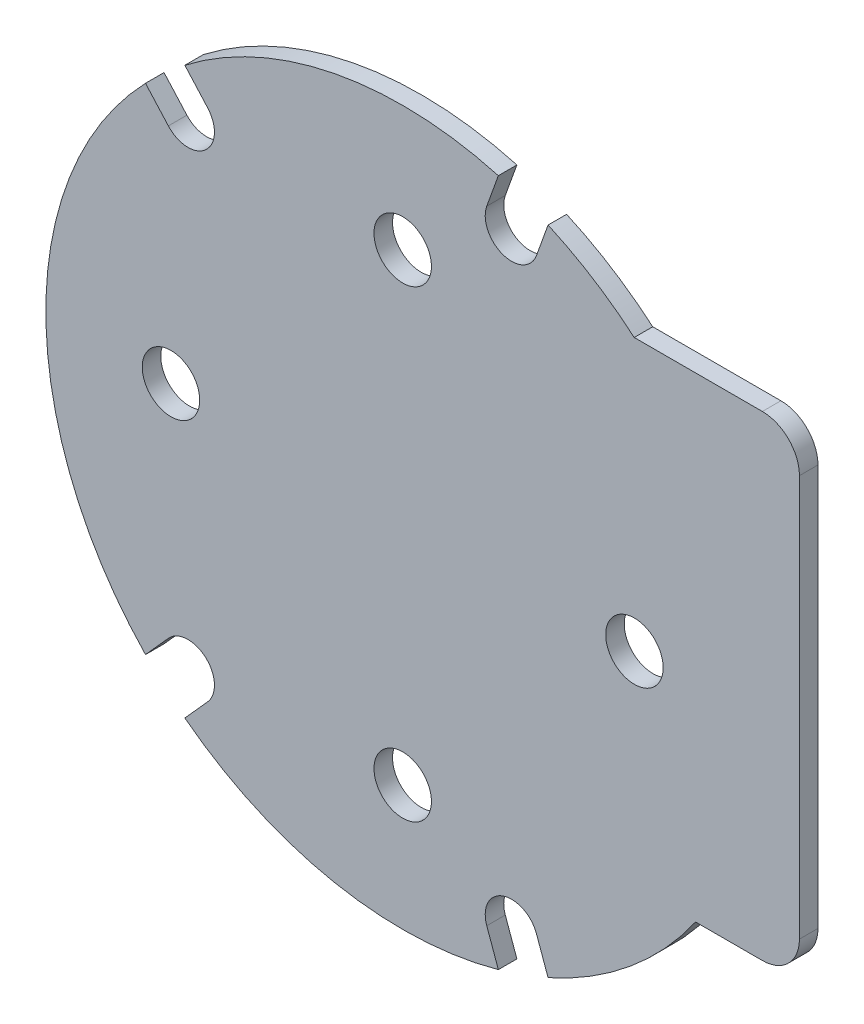
ISO-10303-21;
HEADER;
FILE_DESCRIPTION(('STEP AP214'),'2;1');
FILE_NAME('part.step','',(''),(''),'','','');
FILE_SCHEMA(('AUTOMOTIVE_DESIGN { 1 0 10303 214 1 1 1 1 }'));
ENDSEC;
DATA;
#1=APPLICATION_CONTEXT('core data for automotive mechanical design processes');
#2=APPLICATION_PROTOCOL_DEFINITION('international standard','automotive_design',2000,#1);
#3=PRODUCT_CONTEXT('',#1,'mechanical');
#4=PRODUCT('Part','Part','',(#3));
#5=PRODUCT_RELATED_PRODUCT_CATEGORY('part','',(#4));
#6=PRODUCT_DEFINITION_FORMATION('','',#4);
#7=PRODUCT_DEFINITION_CONTEXT('part definition',#1,'design');
#8=PRODUCT_DEFINITION('design','',#6,#7);
#9=PRODUCT_DEFINITION_SHAPE('','',#8);
#10=(LENGTH_UNIT() NAMED_UNIT(*) SI_UNIT(.MILLI.,.METRE.));
#11=(NAMED_UNIT(*) PLANE_ANGLE_UNIT() SI_UNIT($,.RADIAN.));
#12=(NAMED_UNIT(*) SI_UNIT($,.STERADIAN.) SOLID_ANGLE_UNIT());
#13=UNCERTAINTY_MEASURE_WITH_UNIT(LENGTH_MEASURE(1.E-05),#10,'distance_accuracy_value','');
#14=(GEOMETRIC_REPRESENTATION_CONTEXT(3) GLOBAL_UNCERTAINTY_ASSIGNED_CONTEXT((#13)) GLOBAL_UNIT_ASSIGNED_CONTEXT((#10,
#11,#12)) REPRESENTATION_CONTEXT('',''));
#15=CARTESIAN_POINT('',(0.,0.,0.));
#16=DIRECTION('',(0.,0.,1.));
#17=DIRECTION('',(1.,0.,0.));
#18=AXIS2_PLACEMENT_3D('',#15,#16,#17);
#19=CARTESIAN_POINT('',(0.,0.,2.));
#20=DIRECTION('',(0.,0.,1.));
#21=DIRECTION('',(1.,0.,0.));
#22=AXIS2_PLACEMENT_3D('',#19,#20,#21);
#23=PLANE('',#22);
#24=CARTESIAN_POINT('',(0.,25.,2.));
#25=DIRECTION('',(0.,0.,1.));
#26=DIRECTION('',(1.,0.,0.));
#27=AXIS2_PLACEMENT_3D('',#24,#25,#26);
#28=CIRCLE('',#27,3.1);
#29=CARTESIAN_POINT('',(3.09999999999999,25.,2.));
#30=VERTEX_POINT('',#29);
#31=EDGE_CURVE('E309',#30,#30,#28,.T.);
#32=ORIENTED_EDGE('',*,*,#31,.F.);
#33=EDGE_LOOP('',(#32));
#34=FACE_BOUND('',#33,.T.);
#35=CARTESIAN_POINT('',(0.,-25.,2.));
#36=DIRECTION('',(0.,0.,1.));
#37=DIRECTION('',(1.,0.,0.));
#38=AXIS2_PLACEMENT_3D('',#35,#36,#37);
#39=CIRCLE('',#38,3.1);
#40=CARTESIAN_POINT('',(3.10000000000001,-25.,2.));
#41=VERTEX_POINT('',#40);
#42=EDGE_CURVE('E321',#41,#41,#39,.T.);
#43=ORIENTED_EDGE('',*,*,#42,.F.);
#44=EDGE_LOOP('',(#43));
#45=FACE_BOUND('',#44,.T.);
#46=CARTESIAN_POINT('',(-25.,0.,2.));
#47=DIRECTION('',(0.,0.,1.));
#48=DIRECTION('',(1.,0.,0.));
#49=AXIS2_PLACEMENT_3D('',#46,#47,#48);
#50=CIRCLE('',#49,3.1);
#51=CARTESIAN_POINT('',(-21.9,0.,2.));
#52=VERTEX_POINT('',#51);
#53=EDGE_CURVE('E315',#52,#52,#50,.T.);
#54=ORIENTED_EDGE('',*,*,#53,.F.);
#55=EDGE_LOOP('',(#54));
#56=FACE_BOUND('',#55,.T.);
#57=CARTESIAN_POINT('',(25.,0.,2.));
#58=DIRECTION('',(0.,0.,1.));
#59=DIRECTION('',(1.,0.,0.));
#60=AXIS2_PLACEMENT_3D('',#57,#58,#59);
#61=CIRCLE('',#60,3.1);
#62=CARTESIAN_POINT('',(28.1,0.,2.));
#63=VERTEX_POINT('',#62);
#64=EDGE_CURVE('E303',#63,#63,#61,.T.);
#65=ORIENTED_EDGE('',*,*,#64,.F.);
#66=EDGE_LOOP('',(#65));
#67=FACE_BOUND('',#66,.T.);
#68=DIRECTION('',(0.,1.,0.));
#69=VECTOR('',#68,1.);
#70=CARTESIAN_POINT('',(42.8,29.3,2.));
#71=LINE('',#70,#69);
#72=CARTESIAN_POINT('',(42.8,-18.,2.));
#73=VERTEX_POINT('',#72);
#74=CARTESIAN_POINT('',(42.8,25.3,2.));
#75=VERTEX_POINT('',#74);
#76=EDGE_CURVE('E332',#73,#75,#71,.T.);
#77=ORIENTED_EDGE('',*,*,#76,.T.);
#78=CARTESIAN_POINT('',(38.8,25.3,2.));
#79=DIRECTION('',(0.,0.,1.));
#80=DIRECTION('',(1.,0.,0.));
#81=AXIS2_PLACEMENT_3D('',#78,#79,#80);
#82=CIRCLE('',#81,4.);
#83=CARTESIAN_POINT('',(38.8,29.3,2.));
#84=VERTEX_POINT('',#83);
#85=EDGE_CURVE('E40',#75,#84,#82,.T.);
#86=ORIENTED_EDGE('',*,*,#85,.T.);
#87=DIRECTION('',(-1.,0.,0.));
#88=VECTOR('',#87,1.);
#89=CARTESIAN_POINT('',(24.9751876869825,29.3,2.));
#90=LINE('',#89,#88);
#91=CARTESIAN_POINT('',(24.9751876869825,29.3,2.));
#92=VERTEX_POINT('',#91);
#93=EDGE_CURVE('E334',#84,#92,#90,.T.);
#94=ORIENTED_EDGE('',*,*,#93,.T.);
#95=CARTESIAN_POINT('',(0.,0.,2.));
#96=DIRECTION('',(0.,0.,1.));
#97=DIRECTION('',(1.,0.,0.));
#98=AXIS2_PLACEMENT_3D('',#95,#96,#97);
#99=CIRCLE('',#98,38.5);
#100=CARTESIAN_POINT('',(15.6828384392033,35.161037790285,2.));
#101=VERTEX_POINT('',#100);
#102=EDGE_CURVE('E207',#92,#101,#99,.T.);
#103=ORIENTED_EDGE('',*,*,#102,.T.);
#104=DIRECTION('',(0.338622846225681,0.940922190201729,0.));
#105=VECTOR('',#104,1.);
#106=CARTESIAN_POINT('',(14.4318410061061,31.6849248882568,2.));
#107=LINE('',#106,#105);
#108=CARTESIAN_POINT('',(14.4318410061061,31.6849248882568,2.));
#109=VERTEX_POINT('',#108);
#110=EDGE_CURVE('E194',#109,#101,#107,.T.);
#111=ORIENTED_EDGE('',*,*,#110,.F.);
#112=CARTESIAN_POINT('',(11.7502127640311,32.65,2.));
#113=DIRECTION('',(0.,0.,1.));
#114=DIRECTION('',(1.,0.,0.));
#115=AXIS2_PLACEMENT_3D('',#112,#113,#114);
#116=CIRCLE('',#115,2.85);
#117=CARTESIAN_POINT('',(9.06858452195621,33.6150751117432,2.));
#118=VERTEX_POINT('',#117);
#119=EDGE_CURVE('E184',#118,#109,#116,.T.);
#120=ORIENTED_EDGE('',*,*,#119,.F.);
#121=DIRECTION('',(-0.338622846225681,-0.940922190201729,0.));
#122=VECTOR('',#121,1.);
#123=CARTESIAN_POINT('',(9.06858452195621,33.6150751117432,2.));
#124=LINE('',#123,#122);
#125=CARTESIAN_POINT('',(10.3195819550534,37.0911880137714,2.));
#126=VERTEX_POINT('',#125);
#127=EDGE_CURVE('E208',#126,#118,#124,.T.);
#128=ORIENTED_EDGE('',*,*,#127,.F.);
#129=CARTESIAN_POINT('',(-23.5034170023146,30.493267932698,2.));
#130=VERTEX_POINT('',#129);
#131=EDGE_CURVE('E329',#126,#130,#99,.T.);
#132=ORIENTED_EDGE('',*,*,#131,.T.);
#133=DIRECTION('',(-0.667434411909216,0.744668587896253,0.));
#134=VECTOR('',#133,1.);
#135=CARTESIAN_POINT('',(-21.0376686177454,27.7421880739413,2.));
#136=LINE('',#135,#134);
#137=CARTESIAN_POINT('',(-21.0376686177454,27.7421880739413,2.));
#138=VERTEX_POINT('',#137);
#139=EDGE_CURVE('E224',#138,#130,#136,.T.);
#140=ORIENTED_EDGE('',*,*,#139,.F.);
#141=CARTESIAN_POINT('',(-23.1599740932498,25.84,2.));
#142=DIRECTION('',(0.,0.,1.));
#143=DIRECTION('',(1.,0.,0.));
#144=AXIS2_PLACEMENT_3D('',#141,#142,#143);
#145=CIRCLE('',#144,2.85);
#146=CARTESIAN_POINT('',(-25.2822795687541,23.9378119260587,2.));
#147=VERTEX_POINT('',#146);
#148=EDGE_CURVE('E222',#147,#138,#145,.T.);
#149=ORIENTED_EDGE('',*,*,#148,.F.);
#150=DIRECTION('',(0.667434411909216,-0.744668587896253,0.));
#151=VECTOR('',#150,1.);
#152=CARTESIAN_POINT('',(-25.2822795687541,23.9378119260587,2.));
#153=LINE('',#152,#151);
#154=CARTESIAN_POINT('',(-27.7480279533233,26.6888917848155,2.));
#155=VERTEX_POINT('',#154);
#156=EDGE_CURVE('E228',#155,#147,#153,.T.);
#157=ORIENTED_EDGE('',*,*,#156,.F.);
#158=CARTESIAN_POINT('',(-27.7480279533233,-26.6888917848155,2.));
#159=VERTEX_POINT('',#158);
#160=EDGE_CURVE('E411',#155,#159,#99,.T.);
#161=ORIENTED_EDGE('',*,*,#160,.T.);
#162=DIRECTION('',(-0.667434411909216,-0.744668587896253,0.));
#163=VECTOR('',#162,1.);
#164=CARTESIAN_POINT('',(-25.2822795687541,-23.9378119260587,2.));
#165=LINE('',#164,#163);
#166=CARTESIAN_POINT('',(-25.2822795687541,-23.9378119260587,2.));
#167=VERTEX_POINT('',#166);
#168=EDGE_CURVE('E251',#167,#159,#165,.T.);
#169=ORIENTED_EDGE('',*,*,#168,.F.);
#170=CARTESIAN_POINT('',(-23.1599740932498,-25.84,2.));
#171=DIRECTION('',(0.,0.,1.));
#172=DIRECTION('',(-1.,0.,0.));
#173=AXIS2_PLACEMENT_3D('',#170,#171,#172);
#174=CIRCLE('',#173,2.85);
#175=CARTESIAN_POINT('',(-21.0376686177454,-27.7421880739413,2.));
#176=VERTEX_POINT('',#175);
#177=EDGE_CURVE('E249',#176,#167,#174,.T.);
#178=ORIENTED_EDGE('',*,*,#177,.F.);
#179=DIRECTION('',(0.667434411909216,0.744668587896253,0.));
#180=VECTOR('',#179,1.);
#181=CARTESIAN_POINT('',(-21.0376686177454,-27.7421880739413,2.));
#182=LINE('',#181,#180);
#183=CARTESIAN_POINT('',(-23.5034170023146,-30.493267932698,2.));
#184=VERTEX_POINT('',#183);
#185=EDGE_CURVE('E255',#184,#176,#182,.T.);
#186=ORIENTED_EDGE('',*,*,#185,.F.);
#187=CARTESIAN_POINT('',(10.3195819550534,-37.0911880137714,2.));
#188=VERTEX_POINT('',#187);
#189=EDGE_CURVE('E412',#184,#188,#99,.T.);
#190=ORIENTED_EDGE('',*,*,#189,.T.);
#191=DIRECTION('',(0.338622846225681,-0.940922190201729,0.));
#192=VECTOR('',#191,1.);
#193=CARTESIAN_POINT('',(9.06858452195621,-33.6150751117432,2.));
#194=LINE('',#193,#192);
#195=CARTESIAN_POINT('',(9.06858452195621,-33.6150751117432,2.));
#196=VERTEX_POINT('',#195);
#197=EDGE_CURVE('E278',#196,#188,#194,.T.);
#198=ORIENTED_EDGE('',*,*,#197,.F.);
#199=CARTESIAN_POINT('',(11.7502127640311,-32.65,2.));
#200=DIRECTION('',(0.,0.,1.));
#201=DIRECTION('',(-1.,0.,0.));
#202=AXIS2_PLACEMENT_3D('',#199,#200,#201);
#203=CIRCLE('',#202,2.85);
#204=CARTESIAN_POINT('',(14.4318410061061,-31.6849248882568,2.));
#205=VERTEX_POINT('',#204);
#206=EDGE_CURVE('E276',#205,#196,#203,.T.);
#207=ORIENTED_EDGE('',*,*,#206,.F.);
#208=DIRECTION('',(-0.338622846225681,0.940922190201729,0.));
#209=VECTOR('',#208,1.);
#210=CARTESIAN_POINT('',(14.4318410061061,-31.6849248882568,2.));
#211=LINE('',#210,#209);
#212=CARTESIAN_POINT('',(15.6828384392033,-35.161037790285,2.));
#213=VERTEX_POINT('',#212);
#214=EDGE_CURVE('E282',#213,#205,#211,.T.);
#215=ORIENTED_EDGE('',*,*,#214,.F.);
#216=CARTESIAN_POINT('',(31.5950945559592,-22.,2.));
#217=VERTEX_POINT('',#216);
#218=EDGE_CURVE('E330',#213,#217,#99,.T.);
#219=ORIENTED_EDGE('',*,*,#218,.T.);
#220=DIRECTION('',(1.,0.,0.));
#221=VECTOR('',#220,1.);
#222=CARTESIAN_POINT('',(42.8,-22.,2.));
#223=LINE('',#222,#221);
#224=CARTESIAN_POINT('',(38.8,-22.,2.));
#225=VERTEX_POINT('',#224);
#226=EDGE_CURVE('E328',#217,#225,#223,.T.);
#227=ORIENTED_EDGE('',*,*,#226,.T.);
#228=CARTESIAN_POINT('',(38.8,-18.,2.));
#229=DIRECTION('',(0.,0.,1.));
#230=DIRECTION('',(1.,0.,0.));
#231=AXIS2_PLACEMENT_3D('',#228,#229,#230);
#232=CIRCLE('',#231,4.);
#233=EDGE_CURVE('E363',#225,#73,#232,.T.);
#234=ORIENTED_EDGE('',*,*,#233,.T.);
#235=EDGE_LOOP('',(#77,#86,#94,#103,#111,#120,#128,#132,#140,#149,#157,#161,#169,#178,#186,#190,
#198,#207,#215,#219,#227,#234));
#236=FACE_BOUND('',#235,.T.);
#237=ADVANCED_FACE('F32',(#34,#45,#56,#67,#236),#23,.T.);
#238=CARTESIAN_POINT('',(0.,0.,0.));
#239=DIRECTION('',(0.,0.,1.));
#240=DIRECTION('',(1.,0.,0.));
#241=AXIS2_PLACEMENT_3D('',#238,#239,#240);
#242=PLANE('',#241);
#243=CARTESIAN_POINT('',(0.,25.,0.));
#244=DIRECTION('',(0.,0.,1.));
#245=DIRECTION('',(1.,0.,0.));
#246=AXIS2_PLACEMENT_3D('',#243,#244,#245);
#247=CIRCLE('',#246,3.1);
#248=CARTESIAN_POINT('',(3.09999999999999,25.,0.));
#249=VERTEX_POINT('',#248);
#250=EDGE_CURVE('E306',#249,#249,#247,.T.);
#251=ORIENTED_EDGE('',*,*,#250,.T.);
#252=EDGE_LOOP('',(#251));
#253=FACE_BOUND('',#252,.T.);
#254=CARTESIAN_POINT('',(0.,-25.,0.));
#255=DIRECTION('',(0.,0.,1.));
#256=DIRECTION('',(1.,0.,0.));
#257=AXIS2_PLACEMENT_3D('',#254,#255,#256);
#258=CIRCLE('',#257,3.1);
#259=CARTESIAN_POINT('',(3.10000000000001,-25.,0.));
#260=VERTEX_POINT('',#259);
#261=EDGE_CURVE('E318',#260,#260,#258,.T.);
#262=ORIENTED_EDGE('',*,*,#261,.T.);
#263=EDGE_LOOP('',(#262));
#264=FACE_BOUND('',#263,.T.);
#265=CARTESIAN_POINT('',(-25.,0.,0.));
#266=DIRECTION('',(0.,0.,1.));
#267=DIRECTION('',(1.,0.,0.));
#268=AXIS2_PLACEMENT_3D('',#265,#266,#267);
#269=CIRCLE('',#268,3.1);
#270=CARTESIAN_POINT('',(-21.9,0.,0.));
#271=VERTEX_POINT('',#270);
#272=EDGE_CURVE('E312',#271,#271,#269,.T.);
#273=ORIENTED_EDGE('',*,*,#272,.T.);
#274=EDGE_LOOP('',(#273));
#275=FACE_BOUND('',#274,.T.);
#276=CARTESIAN_POINT('',(25.,0.,0.));
#277=DIRECTION('',(0.,0.,1.));
#278=DIRECTION('',(1.,0.,0.));
#279=AXIS2_PLACEMENT_3D('',#276,#277,#278);
#280=CIRCLE('',#279,3.1);
#281=CARTESIAN_POINT('',(28.1,0.,0.));
#282=VERTEX_POINT('',#281);
#283=EDGE_CURVE('E302',#282,#282,#280,.T.);
#284=ORIENTED_EDGE('',*,*,#283,.T.);
#285=EDGE_LOOP('',(#284));
#286=FACE_BOUND('',#285,.T.);
#287=DIRECTION('',(-1.,0.,0.));
#288=VECTOR('',#287,1.);
#289=CARTESIAN_POINT('',(24.9751876869825,29.3,0.));
#290=LINE('',#289,#288);
#291=CARTESIAN_POINT('',(38.8,29.3,0.));
#292=VERTEX_POINT('',#291);
#293=CARTESIAN_POINT('',(24.9751876869825,29.3,0.));
#294=VERTEX_POINT('',#293);
#295=EDGE_CURVE('E345',#292,#294,#290,.T.);
#296=ORIENTED_EDGE('',*,*,#295,.F.);
#297=CARTESIAN_POINT('',(38.8,25.3,0.));
#298=DIRECTION('',(0.,0.,1.));
#299=DIRECTION('',(1.,0.,0.));
#300=AXIS2_PLACEMENT_3D('',#297,#298,#299);
#301=CIRCLE('',#300,4.);
#302=CARTESIAN_POINT('',(42.8,25.3,0.));
#303=VERTEX_POINT('',#302);
#304=EDGE_CURVE('E357',#292,#303,#301,.F.);
#305=ORIENTED_EDGE('',*,*,#304,.T.);
#306=DIRECTION('',(0.,1.,0.));
#307=VECTOR('',#306,1.);
#308=CARTESIAN_POINT('',(42.8,29.3,0.));
#309=LINE('',#308,#307);
#310=CARTESIAN_POINT('',(42.8,-18.,0.));
#311=VERTEX_POINT('',#310);
#312=EDGE_CURVE('E343',#311,#303,#309,.T.);
#313=ORIENTED_EDGE('',*,*,#312,.F.);
#314=CARTESIAN_POINT('',(38.8,-18.,0.));
#315=DIRECTION('',(0.,0.,1.));
#316=DIRECTION('',(1.,0.,0.));
#317=AXIS2_PLACEMENT_3D('',#314,#315,#316);
#318=CIRCLE('',#317,4.);
#319=CARTESIAN_POINT('',(38.8,-22.,0.));
#320=VERTEX_POINT('',#319);
#321=EDGE_CURVE('E355',#311,#320,#318,.F.);
#322=ORIENTED_EDGE('',*,*,#321,.T.);
#323=DIRECTION('',(1.,0.,0.));
#324=VECTOR('',#323,1.);
#325=CARTESIAN_POINT('',(42.8,-22.,0.));
#326=LINE('',#325,#324);
#327=CARTESIAN_POINT('',(31.5950945559592,-22.,0.));
#328=VERTEX_POINT('',#327);
#329=EDGE_CURVE('E340',#328,#320,#326,.T.);
#330=ORIENTED_EDGE('',*,*,#329,.F.);
#331=CARTESIAN_POINT('',(0.,0.,0.));
#332=DIRECTION('',(0.,0.,1.));
#333=DIRECTION('',(1.,0.,0.));
#334=AXIS2_PLACEMENT_3D('',#331,#332,#333);
#335=CIRCLE('',#334,38.5);
#336=CARTESIAN_POINT('',(15.6828384392033,-35.161037790285,0.));
#337=VERTEX_POINT('',#336);
#338=EDGE_CURVE('E324',#337,#328,#335,.T.);
#339=ORIENTED_EDGE('',*,*,#338,.F.);
#340=DIRECTION('',(-0.338622846225681,0.940922190201729,0.));
#341=VECTOR('',#340,1.);
#342=CARTESIAN_POINT('',(14.4318410061061,-31.6849248882568,0.));
#343=LINE('',#342,#341);
#344=CARTESIAN_POINT('',(14.4318410061061,-31.6849248882568,0.));
#345=VERTEX_POINT('',#344);
#346=EDGE_CURVE('E279',#337,#345,#343,.T.);
#347=ORIENTED_EDGE('',*,*,#346,.T.);
#348=CARTESIAN_POINT('',(11.7502127640311,-32.65,0.));
#349=DIRECTION('',(0.,0.,1.));
#350=DIRECTION('',(-1.,0.,0.));
#351=AXIS2_PLACEMENT_3D('',#348,#349,#350);
#352=CIRCLE('',#351,2.85);
#353=CARTESIAN_POINT('',(9.06858452195621,-33.6150751117432,0.));
#354=VERTEX_POINT('',#353);
#355=EDGE_CURVE('E275',#345,#354,#352,.T.);
#356=ORIENTED_EDGE('',*,*,#355,.T.);
#357=DIRECTION('',(0.338622846225681,-0.940922190201729,0.));
#358=VECTOR('',#357,1.);
#359=CARTESIAN_POINT('',(9.06858452195621,-33.6150751117432,0.));
#360=LINE('',#359,#358);
#361=CARTESIAN_POINT('',(10.3195819550534,-37.0911880137714,0.));
#362=VERTEX_POINT('',#361);
#363=EDGE_CURVE('E287',#354,#362,#360,.T.);
#364=ORIENTED_EDGE('',*,*,#363,.T.);
#365=CARTESIAN_POINT('',(-23.5034170023146,-30.493267932698,0.));
#366=VERTEX_POINT('',#365);
#367=EDGE_CURVE('E388',#366,#362,#335,.T.);
#368=ORIENTED_EDGE('',*,*,#367,.F.);
#369=DIRECTION('',(0.667434411909216,0.744668587896253,0.));
#370=VECTOR('',#369,1.);
#371=CARTESIAN_POINT('',(-21.0376686177454,-27.7421880739413,0.));
#372=LINE('',#371,#370);
#373=CARTESIAN_POINT('',(-21.0376686177454,-27.7421880739413,0.));
#374=VERTEX_POINT('',#373);
#375=EDGE_CURVE('E252',#366,#374,#372,.T.);
#376=ORIENTED_EDGE('',*,*,#375,.T.);
#377=CARTESIAN_POINT('',(-23.1599740932498,-25.84,0.));
#378=DIRECTION('',(0.,0.,1.));
#379=DIRECTION('',(-1.,0.,0.));
#380=AXIS2_PLACEMENT_3D('',#377,#378,#379);
#381=CIRCLE('',#380,2.85);
#382=CARTESIAN_POINT('',(-25.2822795687541,-23.9378119260587,0.));
#383=VERTEX_POINT('',#382);
#384=EDGE_CURVE('E248',#374,#383,#381,.T.);
#385=ORIENTED_EDGE('',*,*,#384,.T.);
#386=DIRECTION('',(-0.667434411909216,-0.744668587896253,0.));
#387=VECTOR('',#386,1.);
#388=CARTESIAN_POINT('',(-25.2822795687541,-23.9378119260587,0.));
#389=LINE('',#388,#387);
#390=CARTESIAN_POINT('',(-27.7480279533233,-26.6888917848155,0.));
#391=VERTEX_POINT('',#390);
#392=EDGE_CURVE('E260',#383,#391,#389,.T.);
#393=ORIENTED_EDGE('',*,*,#392,.T.);
#394=CARTESIAN_POINT('',(-27.7480279533233,26.6888917848155,0.));
#395=VERTEX_POINT('',#394);
#396=EDGE_CURVE('E389',#395,#391,#335,.T.);
#397=ORIENTED_EDGE('',*,*,#396,.F.);
#398=DIRECTION('',(0.667434411909216,-0.744668587896253,0.));
#399=VECTOR('',#398,1.);
#400=CARTESIAN_POINT('',(-25.2822795687541,23.9378119260587,0.));
#401=LINE('',#400,#399);
#402=CARTESIAN_POINT('',(-25.2822795687541,23.9378119260587,0.));
#403=VERTEX_POINT('',#402);
#404=EDGE_CURVE('E225',#395,#403,#401,.T.);
#405=ORIENTED_EDGE('',*,*,#404,.T.);
#406=CARTESIAN_POINT('',(-23.1599740932498,25.84,0.));
#407=DIRECTION('',(0.,0.,1.));
#408=DIRECTION('',(1.,0.,0.));
#409=AXIS2_PLACEMENT_3D('',#406,#407,#408);
#410=CIRCLE('',#409,2.85);
#411=CARTESIAN_POINT('',(-21.0376686177454,27.7421880739413,0.));
#412=VERTEX_POINT('',#411);
#413=EDGE_CURVE('E202',#403,#412,#410,.T.);
#414=ORIENTED_EDGE('',*,*,#413,.T.);
#415=DIRECTION('',(-0.667434411909216,0.744668587896253,0.));
#416=VECTOR('',#415,1.);
#417=CARTESIAN_POINT('',(-21.0376686177454,27.7421880739413,0.));
#418=LINE('',#417,#416);
#419=CARTESIAN_POINT('',(-23.5034170023146,30.493267932698,0.));
#420=VERTEX_POINT('',#419);
#421=EDGE_CURVE('E233',#412,#420,#418,.T.);
#422=ORIENTED_EDGE('',*,*,#421,.T.);
#423=CARTESIAN_POINT('',(10.3195819550534,37.0911880137714,0.));
#424=VERTEX_POINT('',#423);
#425=EDGE_CURVE('E341',#424,#420,#335,.T.);
#426=ORIENTED_EDGE('',*,*,#425,.F.);
#427=DIRECTION('',(-0.338622846225681,-0.940922190201729,0.));
#428=VECTOR('',#427,1.);
#429=CARTESIAN_POINT('',(9.06858452195621,33.6150751117432,0.));
#430=LINE('',#429,#428);
#431=CARTESIAN_POINT('',(9.06858452195621,33.6150751117432,0.));
#432=VERTEX_POINT('',#431);
#433=EDGE_CURVE('E195',#424,#432,#430,.T.);
#434=ORIENTED_EDGE('',*,*,#433,.T.);
#435=CARTESIAN_POINT('',(11.7502127640311,32.65,0.));
#436=DIRECTION('',(0.,0.,1.));
#437=DIRECTION('',(1.,0.,0.));
#438=AXIS2_PLACEMENT_3D('',#435,#436,#437);
#439=CIRCLE('',#438,2.85);
#440=CARTESIAN_POINT('',(14.4318410061061,31.6849248882568,0.));
#441=VERTEX_POINT('',#440);
#442=EDGE_CURVE('E212',#432,#441,#439,.T.);
#443=ORIENTED_EDGE('',*,*,#442,.T.);
#444=DIRECTION('',(0.338622846225681,0.940922190201729,0.));
#445=VECTOR('',#444,1.);
#446=CARTESIAN_POINT('',(14.4318410061061,31.6849248882568,0.));
#447=LINE('',#446,#445);
#448=CARTESIAN_POINT('',(15.6828384392033,35.161037790285,0.));
#449=VERTEX_POINT('',#448);
#450=EDGE_CURVE('E201',#441,#449,#447,.T.);
#451=ORIENTED_EDGE('',*,*,#450,.T.);
#452=EDGE_CURVE('E337',#294,#449,#335,.T.);
#453=ORIENTED_EDGE('',*,*,#452,.F.);
#454=EDGE_LOOP('',(#296,#305,#313,#322,#330,#339,#347,#356,#364,#368,#376,#385,#393,#397,#405,
#414,#422,#426,#434,#443,#451,#453));
#455=FACE_BOUND('',#454,.T.);
#456=ADVANCED_FACE('F375',(#253,#264,#275,#286,#455),#242,.F.);
#457=CARTESIAN_POINT('',(0.,0.,2.));
#458=DIRECTION('',(0.,0.,-1.));
#459=DIRECTION('',(-1.,0.,0.));
#460=AXIS2_PLACEMENT_3D('',#457,#458,#459);
#461=CYLINDRICAL_SURFACE('',#460,38.5);
#462=DIRECTION('',(0.,0.,-1.));
#463=VECTOR('',#462,1.);
#464=CARTESIAN_POINT('',(15.6828384392033,35.161037790285,2.));
#465=LINE('',#464,#463);
#466=EDGE_CURVE('E203',#101,#449,#465,.T.);
#467=ORIENTED_EDGE('',*,*,#466,.F.);
#468=ORIENTED_EDGE('',*,*,#102,.F.);
#469=DIRECTION('',(0.,0.,-1.));
#470=VECTOR('',#469,1.);
#471=CARTESIAN_POINT('',(24.9751876869825,29.3,2.));
#472=LINE('',#471,#470);
#473=EDGE_CURVE('E336',#92,#294,#472,.T.);
#474=ORIENTED_EDGE('',*,*,#473,.T.);
#475=ORIENTED_EDGE('',*,*,#452,.T.);
#476=EDGE_LOOP('',(#467,#468,#474,#475));
#477=FACE_BOUND('',#476,.T.);
#478=ADVANCED_FACE('F457',(#477),#461,.T.);
#479=DIRECTION('',(0.,0.,-1.));
#480=VECTOR('',#479,1.);
#481=CARTESIAN_POINT('',(10.3195819550534,37.0911880137714,2.));
#482=LINE('',#481,#480);
#483=EDGE_CURVE('E218',#126,#424,#482,.T.);
#484=ORIENTED_EDGE('',*,*,#483,.T.);
#485=ORIENTED_EDGE('',*,*,#425,.T.);
#486=DIRECTION('',(0.,0.,-1.));
#487=VECTOR('',#486,1.);
#488=CARTESIAN_POINT('',(-23.5034170023146,30.493267932698,2.));
#489=LINE('',#488,#487);
#490=EDGE_CURVE('E242',#130,#420,#489,.T.);
#491=ORIENTED_EDGE('',*,*,#490,.F.);
#492=ORIENTED_EDGE('',*,*,#131,.F.);
#493=EDGE_LOOP('',(#484,#485,#491,#492));
#494=FACE_BOUND('',#493,.T.);
#495=ADVANCED_FACE('F399',(#494),#461,.T.);
#496=DIRECTION('',(0.,0.,-1.));
#497=VECTOR('',#496,1.);
#498=CARTESIAN_POINT('',(-27.7480279533233,26.6888917848155,2.));
#499=LINE('',#498,#497);
#500=EDGE_CURVE('E239',#155,#395,#499,.T.);
#501=ORIENTED_EDGE('',*,*,#500,.T.);
#502=ORIENTED_EDGE('',*,*,#396,.T.);
#503=DIRECTION('',(0.,0.,-1.));
#504=VECTOR('',#503,1.);
#505=CARTESIAN_POINT('',(-27.7480279533233,-26.6888917848155,2.));
#506=LINE('',#505,#504);
#507=EDGE_CURVE('E269',#159,#391,#506,.T.);
#508=ORIENTED_EDGE('',*,*,#507,.F.);
#509=ORIENTED_EDGE('',*,*,#160,.F.);
#510=EDGE_LOOP('',(#501,#502,#508,#509));
#511=FACE_BOUND('',#510,.T.);
#512=ADVANCED_FACE('F440',(#511),#461,.T.);
#513=DIRECTION('',(0.,0.,-1.));
#514=VECTOR('',#513,1.);
#515=CARTESIAN_POINT('',(-23.5034170023146,-30.493267932698,2.));
#516=LINE('',#515,#514);
#517=EDGE_CURVE('E266',#184,#366,#516,.T.);
#518=ORIENTED_EDGE('',*,*,#517,.T.);
#519=ORIENTED_EDGE('',*,*,#367,.T.);
#520=DIRECTION('',(0.,0.,-1.));
#521=VECTOR('',#520,1.);
#522=CARTESIAN_POINT('',(10.3195819550534,-37.0911880137714,2.));
#523=LINE('',#522,#521);
#524=EDGE_CURVE('E296',#188,#362,#523,.T.);
#525=ORIENTED_EDGE('',*,*,#524,.F.);
#526=ORIENTED_EDGE('',*,*,#189,.F.);
#527=EDGE_LOOP('',(#518,#519,#525,#526));
#528=FACE_BOUND('',#527,.T.);
#529=ADVANCED_FACE('F429',(#528),#461,.T.);
#530=DIRECTION('',(0.,0.,-1.));
#531=VECTOR('',#530,1.);
#532=CARTESIAN_POINT('',(15.6828384392033,-35.161037790285,2.));
#533=LINE('',#532,#531);
#534=EDGE_CURVE('E293',#213,#337,#533,.T.);
#535=ORIENTED_EDGE('',*,*,#534,.T.);
#536=ORIENTED_EDGE('',*,*,#338,.T.);
#537=DIRECTION('',(0.,0.,-1.));
#538=VECTOR('',#537,1.);
#539=CARTESIAN_POINT('',(31.5950945559592,-22.,2.));
#540=LINE('',#539,#538);
#541=EDGE_CURVE('E349',#217,#328,#540,.T.);
#542=ORIENTED_EDGE('',*,*,#541,.F.);
#543=ORIENTED_EDGE('',*,*,#218,.F.);
#544=EDGE_LOOP('',(#535,#536,#542,#543));
#545=FACE_BOUND('',#544,.T.);
#546=ADVANCED_FACE('F387',(#545),#461,.T.);
#547=CARTESIAN_POINT('',(42.8,-22.,2.));
#548=DIRECTION('',(0.,1.,0.));
#549=DIRECTION('',(-1.,0.,0.));
#550=AXIS2_PLACEMENT_3D('',#547,#548,#549);
#551=PLANE('',#550);
#552=ORIENTED_EDGE('',*,*,#329,.T.);
#553=DIRECTION('',(0.,0.,-1.));
#554=VECTOR('',#553,1.);
#555=CARTESIAN_POINT('',(38.8,-22.,2.));
#556=LINE('',#555,#554);
#557=EDGE_CURVE('E11',#320,#225,#556,.F.);
#558=ORIENTED_EDGE('',*,*,#557,.T.);
#559=ORIENTED_EDGE('',*,*,#226,.F.);
#560=ORIENTED_EDGE('',*,*,#541,.T.);
#561=EDGE_LOOP('',(#552,#558,#559,#560));
#562=FACE_BOUND('',#561,.T.);
#563=ADVANCED_FACE('F383',(#562),#551,.F.);
#564=CARTESIAN_POINT('',(42.8,29.3,2.));
#565=DIRECTION('',(-1.,0.,0.));
#566=DIRECTION('',(0.,-1.,0.));
#567=AXIS2_PLACEMENT_3D('',#564,#565,#566);
#568=PLANE('',#567);
#569=ORIENTED_EDGE('',*,*,#312,.T.);
#570=DIRECTION('',(0.,0.,-1.));
#571=VECTOR('',#570,1.);
#572=CARTESIAN_POINT('',(42.8,25.3,2.));
#573=LINE('',#572,#571);
#574=EDGE_CURVE('E53',#303,#75,#573,.F.);
#575=ORIENTED_EDGE('',*,*,#574,.T.);
#576=ORIENTED_EDGE('',*,*,#76,.F.);
#577=DIRECTION('',(0.,0.,-1.));
#578=VECTOR('',#577,1.);
#579=CARTESIAN_POINT('',(42.8,-18.,2.));
#580=LINE('',#579,#578);
#581=EDGE_CURVE('E359',#73,#311,#580,.T.);
#582=ORIENTED_EDGE('',*,*,#581,.T.);
#583=EDGE_LOOP('',(#569,#575,#576,#582));
#584=FACE_BOUND('',#583,.T.);
#585=ADVANCED_FACE('F377',(#584),#568,.F.);
#586=CARTESIAN_POINT('',(24.9751876869825,29.3,2.));
#587=DIRECTION('',(0.,-1.,0.));
#588=DIRECTION('',(0.,0.,-1.));
#589=AXIS2_PLACEMENT_3D('',#586,#587,#588);
#590=PLANE('',#589);
#591=ORIENTED_EDGE('',*,*,#93,.F.);
#592=DIRECTION('',(0.,0.,-1.));
#593=VECTOR('',#592,1.);
#594=CARTESIAN_POINT('',(38.8,29.3,2.));
#595=LINE('',#594,#593);
#596=EDGE_CURVE('E352',#84,#292,#595,.T.);
#597=ORIENTED_EDGE('',*,*,#596,.T.);
#598=ORIENTED_EDGE('',*,*,#295,.T.);
#599=ORIENTED_EDGE('',*,*,#473,.F.);
#600=EDGE_LOOP('',(#591,#597,#598,#599));
#601=FACE_BOUND('',#600,.T.);
#602=ADVANCED_FACE('F370',(#601),#590,.F.);
#603=CARTESIAN_POINT('',(0.,-25.,2.));
#604=DIRECTION('',(0.,0.,-1.));
#605=DIRECTION('',(-1.,0.,0.));
#606=AXIS2_PLACEMENT_3D('',#603,#604,#605);
#607=CYLINDRICAL_SURFACE('',#606,3.1);
#608=ORIENTED_EDGE('',*,*,#42,.T.);
#609=EDGE_LOOP('',(#608));
#610=FACE_BOUND('',#609,.T.);
#611=ORIENTED_EDGE('',*,*,#261,.F.);
#612=EDGE_LOOP('',(#611));
#613=FACE_BOUND('',#612,.T.);
#614=ADVANCED_FACE('F463',(#610,#613),#607,.F.);
#615=CARTESIAN_POINT('',(-25.,0.,2.));
#616=DIRECTION('',(0.,0.,-1.));
#617=DIRECTION('',(-1.,0.,0.));
#618=AXIS2_PLACEMENT_3D('',#615,#616,#617);
#619=CYLINDRICAL_SURFACE('',#618,3.1);
#620=ORIENTED_EDGE('',*,*,#53,.T.);
#621=EDGE_LOOP('',(#620));
#622=FACE_BOUND('',#621,.T.);
#623=ORIENTED_EDGE('',*,*,#272,.F.);
#624=EDGE_LOOP('',(#623));
#625=FACE_BOUND('',#624,.T.);
#626=ADVANCED_FACE('F614',(#622,#625),#619,.F.);
#627=CARTESIAN_POINT('',(0.,25.,2.));
#628=DIRECTION('',(0.,0.,-1.));
#629=DIRECTION('',(-1.,0.,0.));
#630=AXIS2_PLACEMENT_3D('',#627,#628,#629);
#631=CYLINDRICAL_SURFACE('',#630,3.1);
#632=ORIENTED_EDGE('',*,*,#31,.T.);
#633=EDGE_LOOP('',(#632));
#634=FACE_BOUND('',#633,.T.);
#635=ORIENTED_EDGE('',*,*,#250,.F.);
#636=EDGE_LOOP('',(#635));
#637=FACE_BOUND('',#636,.T.);
#638=ADVANCED_FACE('F604',(#634,#637),#631,.F.);
#639=CARTESIAN_POINT('',(25.,0.,2.));
#640=DIRECTION('',(0.,0.,-1.));
#641=DIRECTION('',(-1.,0.,0.));
#642=AXIS2_PLACEMENT_3D('',#639,#640,#641);
#643=CYLINDRICAL_SURFACE('',#642,3.1);
#644=ORIENTED_EDGE('',*,*,#64,.T.);
#645=EDGE_LOOP('',(#644));
#646=FACE_BOUND('',#645,.T.);
#647=ORIENTED_EDGE('',*,*,#283,.F.);
#648=EDGE_LOOP('',(#647));
#649=FACE_BOUND('',#648,.T.);
#650=ADVANCED_FACE('F559',(#646,#649),#643,.F.);
#651=CARTESIAN_POINT('',(11.7502127640311,-32.65,2.));
#652=DIRECTION('',(0.,0.,-1.));
#653=DIRECTION('',(-1.,0.,0.));
#654=AXIS2_PLACEMENT_3D('',#651,#652,#653);
#655=CYLINDRICAL_SURFACE('',#654,2.85);
#656=ORIENTED_EDGE('',*,*,#355,.F.);
#657=DIRECTION('',(0.,0.,-1.));
#658=VECTOR('',#657,1.);
#659=CARTESIAN_POINT('',(14.4318410061061,-31.6849248882568,2.));
#660=LINE('',#659,#658);
#661=EDGE_CURVE('E284',#205,#345,#660,.T.);
#662=ORIENTED_EDGE('',*,*,#661,.F.);
#663=ORIENTED_EDGE('',*,*,#206,.T.);
#664=DIRECTION('',(0.,0.,-1.));
#665=VECTOR('',#664,1.);
#666=CARTESIAN_POINT('',(9.06858452195621,-33.6150751117432,2.));
#667=LINE('',#666,#665);
#668=EDGE_CURVE('E299',#196,#354,#667,.T.);
#669=ORIENTED_EDGE('',*,*,#668,.T.);
#670=EDGE_LOOP('',(#656,#662,#663,#669));
#671=FACE_BOUND('',#670,.T.);
#672=ADVANCED_FACE('F425',(#671),#655,.F.);
#673=CARTESIAN_POINT('',(9.06858452195621,-33.6150751117432,2.));
#674=DIRECTION('',(0.940922190201729,0.338622846225681,0.));
#675=DIRECTION('',(-0.338622846225681,0.940922190201729,0.));
#676=AXIS2_PLACEMENT_3D('',#673,#674,#675);
#677=PLANE('',#676);
#678=ORIENTED_EDGE('',*,*,#363,.F.);
#679=ORIENTED_EDGE('',*,*,#668,.F.);
#680=ORIENTED_EDGE('',*,*,#197,.T.);
#681=ORIENTED_EDGE('',*,*,#524,.T.);
#682=EDGE_LOOP('',(#678,#679,#680,#681));
#683=FACE_BOUND('',#682,.T.);
#684=ADVANCED_FACE('F428',(#683),#677,.T.);
#685=CARTESIAN_POINT('',(14.4318410061061,-31.6849248882568,2.));
#686=DIRECTION('',(-0.940922190201729,-0.338622846225681,0.));
#687=DIRECTION('',(0.338622846225681,-0.940922190201729,0.));
#688=AXIS2_PLACEMENT_3D('',#685,#686,#687);
#689=PLANE('',#688);
#690=ORIENTED_EDGE('',*,*,#346,.F.);
#691=ORIENTED_EDGE('',*,*,#534,.F.);
#692=ORIENTED_EDGE('',*,*,#214,.T.);
#693=ORIENTED_EDGE('',*,*,#661,.T.);
#694=EDGE_LOOP('',(#690,#691,#692,#693));
#695=FACE_BOUND('',#694,.T.);
#696=ADVANCED_FACE('F422',(#695),#689,.T.);
#697=CARTESIAN_POINT('',(-23.1599740932498,-25.84,2.));
#698=DIRECTION('',(0.,0.,-1.));
#699=DIRECTION('',(-1.,0.,0.));
#700=AXIS2_PLACEMENT_3D('',#697,#698,#699);
#701=CYLINDRICAL_SURFACE('',#700,2.85);
#702=ORIENTED_EDGE('',*,*,#384,.F.);
#703=DIRECTION('',(0.,0.,-1.));
#704=VECTOR('',#703,1.);
#705=CARTESIAN_POINT('',(-21.0376686177454,-27.7421880739413,2.));
#706=LINE('',#705,#704);
#707=EDGE_CURVE('E257',#176,#374,#706,.T.);
#708=ORIENTED_EDGE('',*,*,#707,.F.);
#709=ORIENTED_EDGE('',*,*,#177,.T.);
#710=DIRECTION('',(0.,0.,-1.));
#711=VECTOR('',#710,1.);
#712=CARTESIAN_POINT('',(-25.2822795687541,-23.9378119260587,2.));
#713=LINE('',#712,#711);
#714=EDGE_CURVE('E272',#167,#383,#713,.T.);
#715=ORIENTED_EDGE('',*,*,#714,.T.);
#716=EDGE_LOOP('',(#702,#708,#709,#715));
#717=FACE_BOUND('',#716,.T.);
#718=ADVANCED_FACE('F437',(#717),#701,.F.);
#719=CARTESIAN_POINT('',(-25.2822795687541,-23.9378119260587,2.));
#720=DIRECTION('',(0.744668587896253,-0.667434411909216,0.));
#721=DIRECTION('',(0.667434411909216,0.744668587896253,0.));
#722=AXIS2_PLACEMENT_3D('',#719,#720,#721);
#723=PLANE('',#722);
#724=ORIENTED_EDGE('',*,*,#392,.F.);
#725=ORIENTED_EDGE('',*,*,#714,.F.);
#726=ORIENTED_EDGE('',*,*,#168,.T.);
#727=ORIENTED_EDGE('',*,*,#507,.T.);
#728=EDGE_LOOP('',(#724,#725,#726,#727));
#729=FACE_BOUND('',#728,.T.);
#730=ADVANCED_FACE('F439',(#729),#723,.T.);
#731=CARTESIAN_POINT('',(-21.0376686177454,-27.7421880739413,2.));
#732=DIRECTION('',(-0.744668587896253,0.667434411909215,0.));
#733=DIRECTION('',(-0.667434411909216,-0.744668587896253,0.));
#734=AXIS2_PLACEMENT_3D('',#731,#732,#733);
#735=PLANE('',#734);
#736=ORIENTED_EDGE('',*,*,#375,.F.);
#737=ORIENTED_EDGE('',*,*,#517,.F.);
#738=ORIENTED_EDGE('',*,*,#185,.T.);
#739=ORIENTED_EDGE('',*,*,#707,.T.);
#740=EDGE_LOOP('',(#736,#737,#738,#739));
#741=FACE_BOUND('',#740,.T.);
#742=ADVANCED_FACE('F431',(#741),#735,.T.);
#743=CARTESIAN_POINT('',(-23.1599740932498,25.84,2.));
#744=DIRECTION('',(0.,0.,-1.));
#745=DIRECTION('',(-1.,0.,0.));
#746=AXIS2_PLACEMENT_3D('',#743,#744,#745);
#747=CYLINDRICAL_SURFACE('',#746,2.85);
#748=ORIENTED_EDGE('',*,*,#413,.F.);
#749=DIRECTION('',(0.,0.,-1.));
#750=VECTOR('',#749,1.);
#751=CARTESIAN_POINT('',(-25.2822795687541,23.9378119260587,2.));
#752=LINE('',#751,#750);
#753=EDGE_CURVE('E230',#147,#403,#752,.T.);
#754=ORIENTED_EDGE('',*,*,#753,.F.);
#755=ORIENTED_EDGE('',*,*,#148,.T.);
#756=DIRECTION('',(0.,0.,-1.));
#757=VECTOR('',#756,1.);
#758=CARTESIAN_POINT('',(-21.0376686177454,27.7421880739413,2.));
#759=LINE('',#758,#757);
#760=EDGE_CURVE('E245',#138,#412,#759,.T.);
#761=ORIENTED_EDGE('',*,*,#760,.T.);
#762=EDGE_LOOP('',(#748,#754,#755,#761));
#763=FACE_BOUND('',#762,.T.);
#764=ADVANCED_FACE('F408',(#763),#747,.F.);
#765=CARTESIAN_POINT('',(-21.0376686177454,27.7421880739413,2.));
#766=DIRECTION('',(-0.744668587896253,-0.667434411909215,0.));
#767=DIRECTION('',(0.667434411909216,-0.744668587896253,0.));
#768=AXIS2_PLACEMENT_3D('',#765,#766,#767);
#769=PLANE('',#768);
#770=ORIENTED_EDGE('',*,*,#421,.F.);
#771=ORIENTED_EDGE('',*,*,#760,.F.);
#772=ORIENTED_EDGE('',*,*,#139,.T.);
#773=ORIENTED_EDGE('',*,*,#490,.T.);
#774=EDGE_LOOP('',(#770,#771,#772,#773));
#775=FACE_BOUND('',#774,.T.);
#776=ADVANCED_FACE('F402',(#775),#769,.T.);
#777=CARTESIAN_POINT('',(-25.2822795687541,23.9378119260587,2.));
#778=DIRECTION('',(0.744668587896253,0.667434411909216,0.));
#779=DIRECTION('',(-0.667434411909216,0.744668587896253,0.));
#780=AXIS2_PLACEMENT_3D('',#777,#778,#779);
#781=PLANE('',#780);
#782=ORIENTED_EDGE('',*,*,#404,.F.);
#783=ORIENTED_EDGE('',*,*,#500,.F.);
#784=ORIENTED_EDGE('',*,*,#156,.T.);
#785=ORIENTED_EDGE('',*,*,#753,.T.);
#786=EDGE_LOOP('',(#782,#783,#784,#785));
#787=FACE_BOUND('',#786,.T.);
#788=ADVANCED_FACE('F442',(#787),#781,.T.);
#789=CARTESIAN_POINT('',(11.7502127640311,32.65,2.));
#790=DIRECTION('',(0.,0.,-1.));
#791=DIRECTION('',(-1.,0.,0.));
#792=AXIS2_PLACEMENT_3D('',#789,#790,#791);
#793=CYLINDRICAL_SURFACE('',#792,2.85);
#794=ORIENTED_EDGE('',*,*,#442,.F.);
#795=DIRECTION('',(0.,0.,-1.));
#796=VECTOR('',#795,1.);
#797=CARTESIAN_POINT('',(9.06858452195621,33.6150751117432,2.));
#798=LINE('',#797,#796);
#799=EDGE_CURVE('E190',#118,#432,#798,.T.);
#800=ORIENTED_EDGE('',*,*,#799,.F.);
#801=ORIENTED_EDGE('',*,*,#119,.T.);
#802=DIRECTION('',(0.,0.,-1.));
#803=VECTOR('',#802,1.);
#804=CARTESIAN_POINT('',(14.4318410061061,31.6849248882568,2.));
#805=LINE('',#804,#803);
#806=EDGE_CURVE('E188',#109,#441,#805,.T.);
#807=ORIENTED_EDGE('',*,*,#806,.T.);
#808=EDGE_LOOP('',(#794,#800,#801,#807));
#809=FACE_BOUND('',#808,.T.);
#810=ADVANCED_FACE('F187',(#809),#793,.F.);
#811=CARTESIAN_POINT('',(14.4318410061061,31.6849248882568,2.));
#812=DIRECTION('',(-0.940922190201729,0.338622846225681,0.));
#813=DIRECTION('',(-0.338622846225681,-0.940922190201729,0.));
#814=AXIS2_PLACEMENT_3D('',#811,#812,#813);
#815=PLANE('',#814);
#816=ORIENTED_EDGE('',*,*,#450,.F.);
#817=ORIENTED_EDGE('',*,*,#806,.F.);
#818=ORIENTED_EDGE('',*,*,#110,.T.);
#819=ORIENTED_EDGE('',*,*,#466,.T.);
#820=EDGE_LOOP('',(#816,#817,#818,#819));
#821=FACE_BOUND('',#820,.T.);
#822=ADVANCED_FACE('F198',(#821),#815,.T.);
#823=CARTESIAN_POINT('',(9.06858452195621,33.6150751117432,2.));
#824=DIRECTION('',(0.940922190201729,-0.338622846225681,0.));
#825=DIRECTION('',(0.338622846225681,0.940922190201729,0.));
#826=AXIS2_PLACEMENT_3D('',#823,#824,#825);
#827=PLANE('',#826);
#828=ORIENTED_EDGE('',*,*,#433,.F.);
#829=ORIENTED_EDGE('',*,*,#483,.F.);
#830=ORIENTED_EDGE('',*,*,#127,.T.);
#831=ORIENTED_EDGE('',*,*,#799,.T.);
#832=EDGE_LOOP('',(#828,#829,#830,#831));
#833=FACE_BOUND('',#832,.T.);
#834=ADVANCED_FACE('F475',(#833),#827,.T.);
#835=CARTESIAN_POINT('',(38.8,25.3,2.));
#836=DIRECTION('',(0.,0.,-1.));
#837=DIRECTION('',(-1.,0.,0.));
#838=AXIS2_PLACEMENT_3D('',#835,#836,#837);
#839=CYLINDRICAL_SURFACE('',#838,4.);
#840=ORIENTED_EDGE('',*,*,#85,.F.);
#841=ORIENTED_EDGE('',*,*,#574,.F.);
#842=ORIENTED_EDGE('',*,*,#304,.F.);
#843=ORIENTED_EDGE('',*,*,#596,.F.);
#844=EDGE_LOOP('',(#840,#841,#842,#843));
#845=FACE_BOUND('',#844,.T.);
#846=ADVANCED_FACE('F372',(#845),#839,.T.);
#847=CARTESIAN_POINT('',(38.8,-18.,2.));
#848=DIRECTION('',(0.,0.,-1.));
#849=DIRECTION('',(-1.,0.,0.));
#850=AXIS2_PLACEMENT_3D('',#847,#848,#849);
#851=CYLINDRICAL_SURFACE('',#850,4.);
#852=ORIENTED_EDGE('',*,*,#233,.F.);
#853=ORIENTED_EDGE('',*,*,#557,.F.);
#854=ORIENTED_EDGE('',*,*,#321,.F.);
#855=ORIENTED_EDGE('',*,*,#581,.F.);
#856=EDGE_LOOP('',(#852,#853,#854,#855));
#857=FACE_BOUND('',#856,.T.);
#858=ADVANCED_FACE('F34',(#857),#851,.T.);
#859=CLOSED_SHELL('',(#237,#456,#478,#495,#512,#529,#546,#563,#585,#602,#614,#626,#638,#650,
#672,#684,#696,#718,#730,#742,#764,#776,#788,#810,#822,#834,#846,#858));
#860=MANIFOLD_SOLID_BREP('B2',#859);
#861=ADVANCED_BREP_SHAPE_REPRESENTATION('',(#18,#860),#14);
#862=SHAPE_DEFINITION_REPRESENTATION(#9,#861);
ENDSEC;
END-ISO-10303-21;
